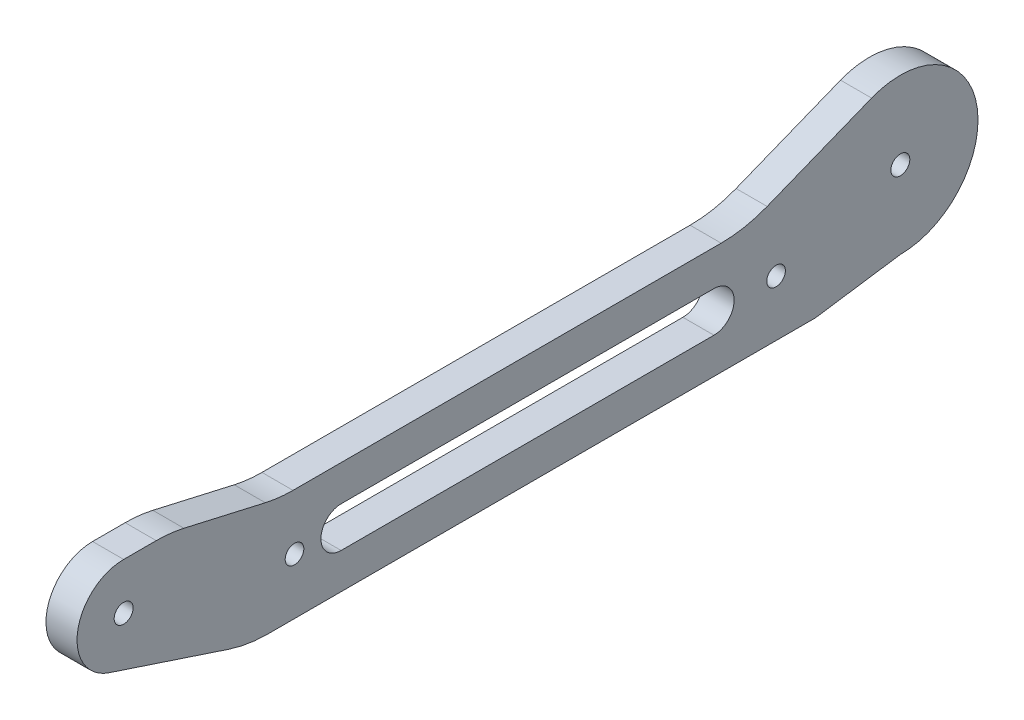
ISO-10303-21;
HEADER;
FILE_DESCRIPTION(('STEP AP214'),'2;1');
FILE_NAME('part.step','',(''),(''),'','','');
FILE_SCHEMA(('AUTOMOTIVE_DESIGN { 1 0 10303 214 1 1 1 1 }'));
ENDSEC;
DATA;
#1=APPLICATION_CONTEXT('core data for automotive mechanical design processes');
#2=APPLICATION_PROTOCOL_DEFINITION('international standard','automotive_design',2000,#1);
#3=PRODUCT_CONTEXT('',#1,'mechanical');
#4=PRODUCT('Part','Part','',(#3));
#5=PRODUCT_RELATED_PRODUCT_CATEGORY('part','',(#4));
#6=PRODUCT_DEFINITION_FORMATION('','',#4);
#7=PRODUCT_DEFINITION_CONTEXT('part definition',#1,'design');
#8=PRODUCT_DEFINITION('design','',#6,#7);
#9=PRODUCT_DEFINITION_SHAPE('','',#8);
#10=(LENGTH_UNIT() NAMED_UNIT(*) SI_UNIT(.MILLI.,.METRE.));
#11=(NAMED_UNIT(*) PLANE_ANGLE_UNIT() SI_UNIT($,.RADIAN.));
#12=(NAMED_UNIT(*) SI_UNIT($,.STERADIAN.) SOLID_ANGLE_UNIT());
#13=UNCERTAINTY_MEASURE_WITH_UNIT(LENGTH_MEASURE(1.E-05),#10,'distance_accuracy_value','');
#14=(GEOMETRIC_REPRESENTATION_CONTEXT(3) GLOBAL_UNCERTAINTY_ASSIGNED_CONTEXT((#13)) GLOBAL_UNIT_ASSIGNED_CONTEXT((#10,
#11,#12)) REPRESENTATION_CONTEXT('',''));
#15=CARTESIAN_POINT('',(0.,0.,0.));
#16=DIRECTION('',(0.,0.,1.));
#17=DIRECTION('',(1.,0.,0.));
#18=AXIS2_PLACEMENT_3D('',#15,#16,#17);
#19=CARTESIAN_POINT('',(2.5,0.,0.));
#20=DIRECTION('',(1.,0.,0.));
#21=DIRECTION('',(0.,0.,-1.));
#22=AXIS2_PLACEMENT_3D('',#19,#20,#21);
#23=PLANE('',#22);
#24=CARTESIAN_POINT('',(2.5,0.,125.));
#25=DIRECTION('',(-1.,0.,0.));
#26=DIRECTION('',(0.,0.,1.));
#27=AXIS2_PLACEMENT_3D('',#24,#25,#26);
#28=CIRCLE('',#27,1.525);
#29=CARTESIAN_POINT('',(2.5,0.,126.525));
#30=VERTEX_POINT('',#29);
#31=EDGE_CURVE('E231',#30,#30,#28,.T.);
#32=ORIENTED_EDGE('',*,*,#31,.T.);
#33=EDGE_LOOP('',(#32));
#34=FACE_BOUND('',#33,.T.);
#35=CARTESIAN_POINT('',(2.5,-5.50000000000001,97.5));
#36=DIRECTION('',(-1.,0.,0.));
#37=DIRECTION('',(0.,0.,1.));
#38=AXIS2_PLACEMENT_3D('',#35,#36,#37);
#39=CIRCLE('',#38,1.5);
#40=CARTESIAN_POINT('',(2.5,-5.50000000000001,99.));
#41=VERTEX_POINT('',#40);
#42=EDGE_CURVE('E234',#41,#41,#39,.T.);
#43=ORIENTED_EDGE('',*,*,#42,.T.);
#44=EDGE_LOOP('',(#43));
#45=FACE_BOUND('',#44,.T.);
#46=CARTESIAN_POINT('',(2.5,-5.5,20.));
#47=DIRECTION('',(-1.,0.,0.));
#48=DIRECTION('',(0.,0.,1.));
#49=AXIS2_PLACEMENT_3D('',#46,#47,#48);
#50=CIRCLE('',#49,1.5);
#51=CARTESIAN_POINT('',(2.5,-5.5,21.5));
#52=VERTEX_POINT('',#51);
#53=EDGE_CURVE('E237',#52,#52,#50,.T.);
#54=ORIENTED_EDGE('',*,*,#53,.T.);
#55=EDGE_LOOP('',(#54));
#56=FACE_BOUND('',#55,.T.);
#57=CARTESIAN_POINT('',(2.5,-5.5,90.));
#58=DIRECTION('',(-1.,0.,0.));
#59=DIRECTION('',(0.,0.,1.));
#60=AXIS2_PLACEMENT_3D('',#57,#58,#59);
#61=CIRCLE('',#60,3.25);
#62=CARTESIAN_POINT('',(2.5,-8.75,90.));
#63=VERTEX_POINT('',#62);
#64=CARTESIAN_POINT('',(2.5,-2.25,90.));
#65=VERTEX_POINT('',#64);
#66=EDGE_CURVE('E244',#63,#65,#61,.T.);
#67=ORIENTED_EDGE('',*,*,#66,.T.);
#68=DIRECTION('',(0.,0.,1.));
#69=VECTOR('',#68,1.);
#70=CARTESIAN_POINT('',(2.5,-2.24999999999998,0.));
#71=LINE('',#70,#69);
#72=CARTESIAN_POINT('',(2.5,-2.24999999999999,30.));
#73=VERTEX_POINT('',#72);
#74=EDGE_CURVE('E163',#65,#73,#71,.F.);
#75=ORIENTED_EDGE('',*,*,#74,.T.);
#76=CARTESIAN_POINT('',(2.5,-5.49999999999999,30.));
#77=DIRECTION('',(-1.,0.,0.));
#78=DIRECTION('',(0.,0.,1.));
#79=AXIS2_PLACEMENT_3D('',#76,#77,#78);
#80=CIRCLE('',#79,3.25);
#81=CARTESIAN_POINT('',(2.5,-8.74999999999999,30.));
#82=VERTEX_POINT('',#81);
#83=EDGE_CURVE('E241',#73,#82,#80,.T.);
#84=ORIENTED_EDGE('',*,*,#83,.T.);
#85=DIRECTION('',(0.,0.,1.));
#86=VECTOR('',#85,1.);
#87=CARTESIAN_POINT('',(2.5,-8.74999999999998,0.));
#88=LINE('',#87,#86);
#89=EDGE_CURVE('E159',#63,#82,#88,.F.);
#90=ORIENTED_EDGE('',*,*,#89,.F.);
#91=EDGE_LOOP('',(#67,#75,#84,#90));
#92=FACE_BOUND('',#91,.T.);
#93=DIRECTION('',(0.,0.,1.));
#94=VECTOR('',#93,1.);
#95=CARTESIAN_POINT('',(2.5,3.5,0.));
#96=LINE('',#95,#94);
#97=CARTESIAN_POINT('',(2.5,3.5,97.7433846449188));
#98=VERTEX_POINT('',#97);
#99=CARTESIAN_POINT('',(2.5,3.5,28.8353597506734));
#100=VERTEX_POINT('',#99);
#101=EDGE_CURVE('E173',#98,#100,#96,.F.);
#102=ORIENTED_EDGE('',*,*,#101,.F.);
#103=CARTESIAN_POINT('',(2.5,23.5,97.7433846449188));
#104=DIRECTION('',(1.,0.,0.));
#105=DIRECTION('',(0.,0.,-1.));
#106=AXIS2_PLACEMENT_3D('',#103,#104,#105);
#107=CIRCLE('',#106,20.);
#108=CARTESIAN_POINT('',(2.5,4.00282986856266,102.199880674962));
#109=VERTEX_POINT('',#108);
#110=EDGE_CURVE('E172',#98,#109,#107,.F.);
#111=ORIENTED_EDGE('',*,*,#110,.T.);
#112=DIRECTION('',(0.,0.222824801502141,0.974858506571867));
#113=VECTOR('',#112,1.);
#114=CARTESIAN_POINT('',(2.5,-18.3960434445307,4.20480993017844));
#115=LINE('',#114,#113);
#116=CARTESIAN_POINT('',(2.5,6.99717013143735,115.300119325038));
#117=VERTEX_POINT('',#116);
#118=EDGE_CURVE('E169',#117,#109,#115,.F.);
#119=ORIENTED_EDGE('',*,*,#118,.F.);
#120=CARTESIAN_POINT('',(2.5,-12.5,119.756615355081));
#121=DIRECTION('',(-1.,0.,0.));
#122=DIRECTION('',(0.,0.,1.));
#123=AXIS2_PLACEMENT_3D('',#120,#121,#122);
#124=CIRCLE('',#123,20.);
#125=CARTESIAN_POINT('',(2.5,7.5,119.756615355081));
#126=VERTEX_POINT('',#125);
#127=EDGE_CURVE('E246',#126,#117,#124,.T.);
#128=ORIENTED_EDGE('',*,*,#127,.F.);
#129=DIRECTION('',(0.,0.,1.));
#130=VECTOR('',#129,1.);
#131=CARTESIAN_POINT('',(2.5,7.4999999999998,0.));
#132=LINE('',#131,#130);
#133=CARTESIAN_POINT('',(2.5,7.50000000000001,125.));
#134=VERTEX_POINT('',#133);
#135=EDGE_CURVE('E147',#134,#126,#132,.F.);
#136=ORIENTED_EDGE('',*,*,#135,.F.);
#137=CARTESIAN_POINT('',(2.5,0.,125.));
#138=DIRECTION('',(-1.,0.,0.));
#139=DIRECTION('',(0.,0.,1.));
#140=AXIS2_PLACEMENT_3D('',#137,#138,#139);
#141=CIRCLE('',#140,7.50000000000001);
#142=CARTESIAN_POINT('',(2.5,-7.12200850271521,127.350956164468));
#143=VERTEX_POINT('',#142);
#144=EDGE_CURVE('E141',#143,#134,#141,.T.);
#145=ORIENTED_EDGE('',*,*,#144,.F.);
#146=DIRECTION('',(0.,-0.313460821929135,-0.949601133695359));
#147=VECTOR('',#146,1.);
#148=CARTESIAN_POINT('',(2.5,-44.3298524868384,14.6331670250296));
#149=LINE('',#148,#147);
#150=CARTESIAN_POINT('',(2.5,-13.4920226739072,108.05357590051));
#151=VERTEX_POINT('',#150);
#152=EDGE_CURVE('E132',#151,#143,#149,.F.);
#153=ORIENTED_EDGE('',*,*,#152,.F.);
#154=CARTESIAN_POINT('',(2.5,5.5,101.784359461928));
#155=DIRECTION('',(1.,0.,0.));
#156=DIRECTION('',(0.,0.,-1.));
#157=AXIS2_PLACEMENT_3D('',#154,#155,#156);
#158=CIRCLE('',#157,20.);
#159=CARTESIAN_POINT('',(2.5,-14.5,101.784359461928));
#160=VERTEX_POINT('',#159);
#161=EDGE_CURVE('E153',#160,#151,#158,.F.);
#162=ORIENTED_EDGE('',*,*,#161,.F.);
#163=DIRECTION('',(0.,0.,1.));
#164=VECTOR('',#163,1.);
#165=CARTESIAN_POINT('',(2.5,-14.5,0.));
#166=LINE('',#165,#164);
#167=CARTESIAN_POINT('',(2.5,-14.5,13.675));
#168=VERTEX_POINT('',#167);
#169=EDGE_CURVE('E188',#160,#168,#166,.F.);
#170=ORIENTED_EDGE('',*,*,#169,.T.);
#171=DIRECTION('',(0.,-0.144712790159397,0.989473702714874));
#172=VECTOR('',#171,1.);
#173=CARTESIAN_POINT('',(2.5,-12.2382276045535,-1.78986875386523));
#174=LINE('',#173,#172);
#175=CARTESIAN_POINT('',(2.5,-12.5,0.));
#176=VERTEX_POINT('',#175);
#177=EDGE_CURVE('E181',#168,#176,#174,.F.);
#178=ORIENTED_EDGE('',*,*,#177,.T.);
#179=CARTESIAN_POINT('',(2.5,0.,0.));
#180=DIRECTION('',(-1.,0.,0.));
#181=DIRECTION('',(0.,0.,1.));
#182=AXIS2_PLACEMENT_3D('',#179,#180,#181);
#183=CIRCLE('',#182,12.5);
#184=CARTESIAN_POINT('',(2.5,11.6132366611717,4.62414686743597));
#185=VERTEX_POINT('',#184);
#186=EDGE_CURVE('E184',#185,#176,#183,.T.);
#187=ORIENTED_EDGE('',*,*,#186,.F.);
#188=DIRECTION('',(0.,-0.369931749394877,0.929058932893735));
#189=VECTOR('',#188,1.);
#190=CARTESIAN_POINT('',(2.5,11.6132366611717,4.62414686743597));
#191=LINE('',#190,#189);
#192=CARTESIAN_POINT('',(2.5,4.9188213421253,21.4367247627758));
#193=VERTEX_POINT('',#192);
#194=EDGE_CURVE('E177',#193,#185,#191,.F.);
#195=ORIENTED_EDGE('',*,*,#194,.F.);
#196=CARTESIAN_POINT('',(2.5,23.5,28.8353597506734));
#197=DIRECTION('',(1.,0.,0.));
#198=DIRECTION('',(0.,0.,-1.));
#199=AXIS2_PLACEMENT_3D('',#196,#197,#198);
#200=CIRCLE('',#199,20.);
#201=EDGE_CURVE('E176',#193,#100,#200,.F.);
#202=ORIENTED_EDGE('',*,*,#201,.T.);
#203=EDGE_LOOP('',(#102,#111,#119,#128,#136,#145,#153,#162,#170,#178,#187,#195,#202));
#204=FACE_BOUND('',#203,.T.);
#205=CARTESIAN_POINT('',(2.5,0.,0.));
#206=DIRECTION('',(-1.,0.,0.));
#207=DIRECTION('',(0.,0.,1.));
#208=AXIS2_PLACEMENT_3D('',#205,#206,#207);
#209=CIRCLE('',#208,1.525);
#210=CARTESIAN_POINT('',(2.5,0.,1.525));
#211=VERTEX_POINT('',#210);
#212=EDGE_CURVE('E19',#211,#211,#209,.T.);
#213=ORIENTED_EDGE('',*,*,#212,.T.);
#214=EDGE_LOOP('',(#213));
#215=FACE_BOUND('',#214,.T.);
#216=ADVANCED_FACE('F16',(#34,#45,#56,#92,#204,#215),#23,.T.);
#217=CARTESIAN_POINT('',(2.5,0.,0.));
#218=DIRECTION('',(-1.,0.,0.));
#219=DIRECTION('',(0.,0.,1.));
#220=AXIS2_PLACEMENT_3D('',#217,#218,#219);
#221=CYLINDRICAL_SURFACE('',#220,1.525);
#222=CARTESIAN_POINT('',(-2.5,0.,0.));
#223=DIRECTION('',(-1.,0.,0.));
#224=DIRECTION('',(0.,0.,1.));
#225=AXIS2_PLACEMENT_3D('',#222,#223,#224);
#226=CIRCLE('',#225,1.525);
#227=CARTESIAN_POINT('',(-2.5,0.,1.525));
#228=VERTEX_POINT('',#227);
#229=EDGE_CURVE('E228',#228,#228,#226,.T.);
#230=ORIENTED_EDGE('',*,*,#229,.T.);
#231=EDGE_LOOP('',(#230));
#232=FACE_BOUND('',#231,.T.);
#233=ORIENTED_EDGE('',*,*,#212,.F.);
#234=EDGE_LOOP('',(#233));
#235=FACE_BOUND('',#234,.T.);
#236=ADVANCED_FACE('F405',(#232,#235),#221,.F.);
#237=CARTESIAN_POINT('',(2.5,0.,125.));
#238=DIRECTION('',(-1.,0.,0.));
#239=DIRECTION('',(0.,0.,1.));
#240=AXIS2_PLACEMENT_3D('',#237,#238,#239);
#241=CYLINDRICAL_SURFACE('',#240,7.50000000000001);
#242=CARTESIAN_POINT('',(-2.5,0.,125.));
#243=DIRECTION('',(-1.,0.,0.));
#244=DIRECTION('',(0.,0.,1.));
#245=AXIS2_PLACEMENT_3D('',#242,#243,#244);
#246=CIRCLE('',#245,7.50000000000001);
#247=CARTESIAN_POINT('',(-2.5,7.50000000000001,125.));
#248=VERTEX_POINT('',#247);
#249=CARTESIAN_POINT('',(-2.5,-7.1220085027152,127.350956164469));
#250=VERTEX_POINT('',#249);
#251=EDGE_CURVE('E152',#248,#250,#246,.F.);
#252=ORIENTED_EDGE('',*,*,#251,.T.);
#253=DIRECTION('',(1.,0.,0.));
#254=VECTOR('',#253,1.);
#255=CARTESIAN_POINT('',(2.5,-7.12200850271521,127.350956164468));
#256=LINE('',#255,#254);
#257=EDGE_CURVE('E137',#143,#250,#256,.F.);
#258=ORIENTED_EDGE('',*,*,#257,.F.);
#259=ORIENTED_EDGE('',*,*,#144,.T.);
#260=DIRECTION('',(1.,0.,0.));
#261=VECTOR('',#260,1.);
#262=CARTESIAN_POINT('',(2.5,7.50000000000001,125.));
#263=LINE('',#262,#261);
#264=EDGE_CURVE('E162',#248,#134,#263,.T.);
#265=ORIENTED_EDGE('',*,*,#264,.F.);
#266=EDGE_LOOP('',(#252,#258,#259,#265));
#267=FACE_BOUND('',#266,.T.);
#268=ADVANCED_FACE('F151',(#267),#241,.T.);
#269=CARTESIAN_POINT('',(2.5,-44.3298524868384,14.6331670250296));
#270=DIRECTION('',(0.,-0.949601133695359,0.313460821929135));
#271=DIRECTION('',(0.,-0.313460821929135,-0.949601133695359));
#272=AXIS2_PLACEMENT_3D('',#269,#270,#271);
#273=PLANE('',#272);
#274=ORIENTED_EDGE('',*,*,#152,.T.);
#275=ORIENTED_EDGE('',*,*,#257,.T.);
#276=DIRECTION('',(0.,-0.313460821929135,-0.949601133695359));
#277=VECTOR('',#276,1.);
#278=CARTESIAN_POINT('',(-2.5,-7.12200850271521,127.350956164468));
#279=LINE('',#278,#277);
#280=CARTESIAN_POINT('',(-2.5,-13.4920226739072,108.05357590051));
#281=VERTEX_POINT('',#280);
#282=EDGE_CURVE('E226',#250,#281,#279,.T.);
#283=ORIENTED_EDGE('',*,*,#282,.T.);
#284=DIRECTION('',(1.,0.,0.));
#285=VECTOR('',#284,1.);
#286=CARTESIAN_POINT('',(2.5,-13.4920226739072,108.05357590051));
#287=LINE('',#286,#285);
#288=EDGE_CURVE('E139',#151,#281,#287,.F.);
#289=ORIENTED_EDGE('',*,*,#288,.F.);
#290=EDGE_LOOP('',(#274,#275,#283,#289));
#291=FACE_BOUND('',#290,.T.);
#292=ADVANCED_FACE('F134',(#291),#273,.T.);
#293=CARTESIAN_POINT('',(2.5,5.5,101.784359461928));
#294=DIRECTION('',(1.,0.,0.));
#295=DIRECTION('',(0.,0.,-1.));
#296=AXIS2_PLACEMENT_3D('',#293,#294,#295);
#297=CYLINDRICAL_SURFACE('',#296,20.);
#298=CARTESIAN_POINT('',(-2.5,5.5,101.784359461928));
#299=DIRECTION('',(1.,0.,0.));
#300=DIRECTION('',(0.,0.,-1.));
#301=AXIS2_PLACEMENT_3D('',#298,#299,#300);
#302=CIRCLE('',#301,20.);
#303=CARTESIAN_POINT('',(-2.5,-14.5,101.784359461928));
#304=VERTEX_POINT('',#303);
#305=EDGE_CURVE('E222',#281,#304,#302,.T.);
#306=ORIENTED_EDGE('',*,*,#305,.T.);
#307=DIRECTION('',(1.,0.,0.));
#308=VECTOR('',#307,1.);
#309=CARTESIAN_POINT('',(2.5,-14.5,101.784359461928));
#310=LINE('',#309,#308);
#311=EDGE_CURVE('E191',#304,#160,#310,.T.);
#312=ORIENTED_EDGE('',*,*,#311,.T.);
#313=ORIENTED_EDGE('',*,*,#161,.T.);
#314=ORIENTED_EDGE('',*,*,#288,.T.);
#315=EDGE_LOOP('',(#306,#312,#313,#314));
#316=FACE_BOUND('',#315,.T.);
#317=ADVANCED_FACE('F269',(#316),#297,.T.);
#318=CARTESIAN_POINT('',(2.5,-14.5,0.));
#319=DIRECTION('',(0.,1.,0.));
#320=DIRECTION('',(0.,0.,1.));
#321=AXIS2_PLACEMENT_3D('',#318,#319,#320);
#322=PLANE('',#321);
#323=ORIENTED_EDGE('',*,*,#311,.F.);
#324=DIRECTION('',(0.,0.,-1.));
#325=VECTOR('',#324,1.);
#326=CARTESIAN_POINT('',(-2.5,-14.5,0.));
#327=LINE('',#326,#325);
#328=CARTESIAN_POINT('',(-2.5,-14.5,13.6749999999999));
#329=VERTEX_POINT('',#328);
#330=EDGE_CURVE('E225',#304,#329,#327,.T.);
#331=ORIENTED_EDGE('',*,*,#330,.T.);
#332=DIRECTION('',(1.,0.,0.));
#333=VECTOR('',#332,1.);
#334=CARTESIAN_POINT('',(2.5,-14.5,13.675));
#335=LINE('',#334,#333);
#336=EDGE_CURVE('E185',#329,#168,#335,.T.);
#337=ORIENTED_EDGE('',*,*,#336,.T.);
#338=ORIENTED_EDGE('',*,*,#169,.F.);
#339=EDGE_LOOP('',(#323,#331,#337,#338));
#340=FACE_BOUND('',#339,.T.);
#341=ADVANCED_FACE('F315',(#340),#322,.F.);
#342=CARTESIAN_POINT('',(2.5,-12.2382276045535,-1.78986875386523));
#343=DIRECTION('',(0.,0.989473702714874,0.144712790159397));
#344=DIRECTION('',(0.,-0.144712790159397,0.989473702714874));
#345=AXIS2_PLACEMENT_3D('',#342,#343,#344);
#346=PLANE('',#345);
#347=DIRECTION('',(-1.,0.,0.));
#348=VECTOR('',#347,1.);
#349=CARTESIAN_POINT('',(2.5,-12.5,0.));
#350=LINE('',#349,#348);
#351=CARTESIAN_POINT('',(-2.5,-12.5,0.));
#352=VERTEX_POINT('',#351);
#353=EDGE_CURVE('E180',#176,#352,#350,.T.);
#354=ORIENTED_EDGE('',*,*,#353,.F.);
#355=ORIENTED_EDGE('',*,*,#177,.F.);
#356=ORIENTED_EDGE('',*,*,#336,.F.);
#357=DIRECTION('',(0.,0.144712790159397,-0.989473702714874));
#358=VECTOR('',#357,1.);
#359=CARTESIAN_POINT('',(-2.5,-14.5,13.675));
#360=LINE('',#359,#358);
#361=EDGE_CURVE('E221',#329,#352,#360,.T.);
#362=ORIENTED_EDGE('',*,*,#361,.T.);
#363=EDGE_LOOP('',(#354,#355,#356,#362));
#364=FACE_BOUND('',#363,.T.);
#365=ADVANCED_FACE('F306',(#364),#346,.F.);
#366=CARTESIAN_POINT('',(2.5,0.,0.));
#367=DIRECTION('',(-1.,0.,0.));
#368=DIRECTION('',(0.,0.,1.));
#369=AXIS2_PLACEMENT_3D('',#366,#367,#368);
#370=CYLINDRICAL_SURFACE('',#369,12.5);
#371=ORIENTED_EDGE('',*,*,#186,.T.);
#372=ORIENTED_EDGE('',*,*,#353,.T.);
#373=CARTESIAN_POINT('',(-2.5,0.,0.));
#374=DIRECTION('',(-1.,0.,0.));
#375=DIRECTION('',(0.,0.,1.));
#376=AXIS2_PLACEMENT_3D('',#373,#374,#375);
#377=CIRCLE('',#376,12.5);
#378=CARTESIAN_POINT('',(-2.5,11.6132366611717,4.62414686743597));
#379=VERTEX_POINT('',#378);
#380=EDGE_CURVE('E218',#352,#379,#377,.F.);
#381=ORIENTED_EDGE('',*,*,#380,.T.);
#382=DIRECTION('',(1.,0.,0.));
#383=VECTOR('',#382,1.);
#384=CARTESIAN_POINT('',(2.5,11.6132366611717,4.62414686743597));
#385=LINE('',#384,#383);
#386=EDGE_CURVE('E179',#185,#379,#385,.F.);
#387=ORIENTED_EDGE('',*,*,#386,.F.);
#388=EDGE_LOOP('',(#371,#372,#381,#387));
#389=FACE_BOUND('',#388,.T.);
#390=ADVANCED_FACE('F304',(#389),#370,.T.);
#391=CARTESIAN_POINT('',(2.5,11.6132366611717,4.62414686743597));
#392=DIRECTION('',(0.,0.929058932893735,0.369931749394877));
#393=DIRECTION('',(0.,-0.369931749394877,0.929058932893735));
#394=AXIS2_PLACEMENT_3D('',#391,#392,#393);
#395=PLANE('',#394);
#396=ORIENTED_EDGE('',*,*,#194,.T.);
#397=ORIENTED_EDGE('',*,*,#386,.T.);
#398=DIRECTION('',(0.,-0.369931749394877,0.929058932893735));
#399=VECTOR('',#398,1.);
#400=CARTESIAN_POINT('',(-2.5,11.6132366611717,4.62414686743596));
#401=LINE('',#400,#399);
#402=CARTESIAN_POINT('',(-2.5,4.9188213421253,21.4367247627758));
#403=VERTEX_POINT('',#402);
#404=EDGE_CURVE('E217',#379,#403,#401,.T.);
#405=ORIENTED_EDGE('',*,*,#404,.T.);
#406=DIRECTION('',(1.,0.,0.));
#407=VECTOR('',#406,1.);
#408=CARTESIAN_POINT('',(2.5,4.91882134212529,21.4367247627758));
#409=LINE('',#408,#407);
#410=EDGE_CURVE('E253',#403,#193,#409,.T.);
#411=ORIENTED_EDGE('',*,*,#410,.T.);
#412=EDGE_LOOP('',(#396,#397,#405,#411));
#413=FACE_BOUND('',#412,.T.);
#414=ADVANCED_FACE('F299',(#413),#395,.T.);
#415=CARTESIAN_POINT('',(2.5,23.5,28.8353597506734));
#416=DIRECTION('',(1.,0.,0.));
#417=DIRECTION('',(0.,0.,-1.));
#418=AXIS2_PLACEMENT_3D('',#415,#416,#417);
#419=CYLINDRICAL_SURFACE('',#418,20.);
#420=ORIENTED_EDGE('',*,*,#410,.F.);
#421=CARTESIAN_POINT('',(-2.5,23.5,28.8353597506734));
#422=DIRECTION('',(1.,0.,0.));
#423=DIRECTION('',(0.,0.,-1.));
#424=AXIS2_PLACEMENT_3D('',#421,#422,#423);
#425=CIRCLE('',#424,20.);
#426=CARTESIAN_POINT('',(-2.5,3.5,28.8353597506734));
#427=VERTEX_POINT('',#426);
#428=EDGE_CURVE('E214',#403,#427,#425,.F.);
#429=ORIENTED_EDGE('',*,*,#428,.T.);
#430=DIRECTION('',(1.,0.,0.));
#431=VECTOR('',#430,1.);
#432=CARTESIAN_POINT('',(2.5,3.5,28.8353597506734));
#433=LINE('',#432,#431);
#434=EDGE_CURVE('E175',#100,#427,#433,.F.);
#435=ORIENTED_EDGE('',*,*,#434,.F.);
#436=ORIENTED_EDGE('',*,*,#201,.F.);
#437=EDGE_LOOP('',(#420,#429,#435,#436));
#438=FACE_BOUND('',#437,.T.);
#439=ADVANCED_FACE('F313',(#438),#419,.F.);
#440=CARTESIAN_POINT('',(2.5,3.5,0.));
#441=DIRECTION('',(0.,1.,0.));
#442=DIRECTION('',(0.,0.,1.));
#443=AXIS2_PLACEMENT_3D('',#440,#441,#442);
#444=PLANE('',#443);
#445=ORIENTED_EDGE('',*,*,#101,.T.);
#446=ORIENTED_EDGE('',*,*,#434,.T.);
#447=DIRECTION('',(0.,0.,-1.));
#448=VECTOR('',#447,1.);
#449=CARTESIAN_POINT('',(-2.5,3.5,0.));
#450=LINE('',#449,#448);
#451=CARTESIAN_POINT('',(-2.5,3.5,97.7433846449188));
#452=VERTEX_POINT('',#451);
#453=EDGE_CURVE('E213',#427,#452,#450,.F.);
#454=ORIENTED_EDGE('',*,*,#453,.T.);
#455=DIRECTION('',(1.,0.,0.));
#456=VECTOR('',#455,1.);
#457=CARTESIAN_POINT('',(2.5,3.5,97.7433846449188));
#458=LINE('',#457,#456);
#459=EDGE_CURVE('E250',#452,#98,#458,.T.);
#460=ORIENTED_EDGE('',*,*,#459,.T.);
#461=EDGE_LOOP('',(#445,#446,#454,#460));
#462=FACE_BOUND('',#461,.T.);
#463=ADVANCED_FACE('F368',(#462),#444,.T.);
#464=CARTESIAN_POINT('',(2.5,23.5,97.7433846449188));
#465=DIRECTION('',(1.,0.,0.));
#466=DIRECTION('',(0.,0.,-1.));
#467=AXIS2_PLACEMENT_3D('',#464,#465,#466);
#468=CYLINDRICAL_SURFACE('',#467,20.);
#469=ORIENTED_EDGE('',*,*,#459,.F.);
#470=CARTESIAN_POINT('',(-2.5,23.5,97.7433846449188));
#471=DIRECTION('',(1.,0.,0.));
#472=DIRECTION('',(0.,0.,-1.));
#473=AXIS2_PLACEMENT_3D('',#470,#471,#472);
#474=CIRCLE('',#473,20.);
#475=CARTESIAN_POINT('',(-2.5,4.00282986856266,102.199880674962));
#476=VERTEX_POINT('',#475);
#477=EDGE_CURVE('E210',#452,#476,#474,.F.);
#478=ORIENTED_EDGE('',*,*,#477,.T.);
#479=DIRECTION('',(1.,0.,0.));
#480=VECTOR('',#479,1.);
#481=CARTESIAN_POINT('',(2.5,4.00282986856267,102.199880674962));
#482=LINE('',#481,#480);
#483=EDGE_CURVE('E171',#109,#476,#482,.F.);
#484=ORIENTED_EDGE('',*,*,#483,.F.);
#485=ORIENTED_EDGE('',*,*,#110,.F.);
#486=EDGE_LOOP('',(#469,#478,#484,#485));
#487=FACE_BOUND('',#486,.T.);
#488=ADVANCED_FACE('F364',(#487),#468,.F.);
#489=CARTESIAN_POINT('',(2.5,-18.3960434445307,4.20480993017844));
#490=DIRECTION('',(0.,0.974858506571867,-0.222824801502141));
#491=DIRECTION('',(0.,0.222824801502141,0.974858506571867));
#492=AXIS2_PLACEMENT_3D('',#489,#490,#491);
#493=PLANE('',#492);
#494=ORIENTED_EDGE('',*,*,#118,.T.);
#495=ORIENTED_EDGE('',*,*,#483,.T.);
#496=DIRECTION('',(0.,0.222824801502141,0.974858506571867));
#497=VECTOR('',#496,1.);
#498=CARTESIAN_POINT('',(-2.5,4.00282986856266,102.199880674962));
#499=LINE('',#498,#497);
#500=CARTESIAN_POINT('',(-2.5,6.99717013143735,115.300119325038));
#501=VERTEX_POINT('',#500);
#502=EDGE_CURVE('E209',#476,#501,#499,.T.);
#503=ORIENTED_EDGE('',*,*,#502,.T.);
#504=DIRECTION('',(-1.,0.,0.));
#505=VECTOR('',#504,1.);
#506=CARTESIAN_POINT('',(2.5,6.99717013143735,115.300119325038));
#507=LINE('',#506,#505);
#508=EDGE_CURVE('E168',#117,#501,#507,.T.);
#509=ORIENTED_EDGE('',*,*,#508,.F.);
#510=EDGE_LOOP('',(#494,#495,#503,#509));
#511=FACE_BOUND('',#510,.T.);
#512=ADVANCED_FACE('F360',(#511),#493,.T.);
#513=CARTESIAN_POINT('',(2.5,-12.5,119.756615355081));
#514=DIRECTION('',(-1.,0.,0.));
#515=DIRECTION('',(0.,0.,1.));
#516=AXIS2_PLACEMENT_3D('',#513,#514,#515);
#517=CYLINDRICAL_SURFACE('',#516,20.);
#518=CARTESIAN_POINT('',(-2.5,-12.5,119.756615355081));
#519=DIRECTION('',(-1.,0.,0.));
#520=DIRECTION('',(0.,0.,1.));
#521=AXIS2_PLACEMENT_3D('',#518,#519,#520);
#522=CIRCLE('',#521,20.);
#523=CARTESIAN_POINT('',(-2.5,7.50000000000001,119.756615355081));
#524=VERTEX_POINT('',#523);
#525=EDGE_CURVE('E205',#501,#524,#522,.F.);
#526=ORIENTED_EDGE('',*,*,#525,.T.);
#527=DIRECTION('',(1.,0.,0.));
#528=VECTOR('',#527,1.);
#529=CARTESIAN_POINT('',(2.5,7.5,119.756615355081));
#530=LINE('',#529,#528);
#531=EDGE_CURVE('E167',#126,#524,#530,.F.);
#532=ORIENTED_EDGE('',*,*,#531,.F.);
#533=ORIENTED_EDGE('',*,*,#127,.T.);
#534=ORIENTED_EDGE('',*,*,#508,.T.);
#535=EDGE_LOOP('',(#526,#532,#533,#534));
#536=FACE_BOUND('',#535,.T.);
#537=ADVANCED_FACE('F356',(#536),#517,.T.);
#538=CARTESIAN_POINT('',(2.5,7.4999999999998,0.));
#539=DIRECTION('',(0.,1.,0.));
#540=DIRECTION('',(0.,0.,1.));
#541=AXIS2_PLACEMENT_3D('',#538,#539,#540);
#542=PLANE('',#541);
#543=DIRECTION('',(0.,0.,-1.));
#544=VECTOR('',#543,1.);
#545=CARTESIAN_POINT('',(-2.5,7.50000000000001,0.));
#546=LINE('',#545,#544);
#547=EDGE_CURVE('E208',#524,#248,#546,.F.);
#548=ORIENTED_EDGE('',*,*,#547,.T.);
#549=ORIENTED_EDGE('',*,*,#264,.T.);
#550=ORIENTED_EDGE('',*,*,#135,.T.);
#551=ORIENTED_EDGE('',*,*,#531,.T.);
#552=EDGE_LOOP('',(#548,#549,#550,#551));
#553=FACE_BOUND('',#552,.T.);
#554=ADVANCED_FACE('F352',(#553),#542,.T.);
#555=CARTESIAN_POINT('',(2.5,-8.74999999999998,0.));
#556=DIRECTION('',(0.,1.,0.));
#557=DIRECTION('',(0.,0.,1.));
#558=AXIS2_PLACEMENT_3D('',#555,#556,#557);
#559=PLANE('',#558);
#560=ORIENTED_EDGE('',*,*,#89,.T.);
#561=DIRECTION('',(-1.,0.,0.));
#562=VECTOR('',#561,1.);
#563=CARTESIAN_POINT('',(2.5,-8.74999999999999,30.));
#564=LINE('',#563,#562);
#565=CARTESIAN_POINT('',(-2.5,-8.74999999999999,30.));
#566=VERTEX_POINT('',#565);
#567=EDGE_CURVE('E240',#82,#566,#564,.T.);
#568=ORIENTED_EDGE('',*,*,#567,.T.);
#569=DIRECTION('',(0.,0.,-1.));
#570=VECTOR('',#569,1.);
#571=CARTESIAN_POINT('',(-2.5,-8.74999999999999,0.));
#572=LINE('',#571,#570);
#573=CARTESIAN_POINT('',(-2.5,-8.75,90.));
#574=VERTEX_POINT('',#573);
#575=EDGE_CURVE('E204',#566,#574,#572,.F.);
#576=ORIENTED_EDGE('',*,*,#575,.T.);
#577=DIRECTION('',(-1.,0.,0.));
#578=VECTOR('',#577,1.);
#579=CARTESIAN_POINT('',(2.5,-8.75,90.));
#580=LINE('',#579,#578);
#581=EDGE_CURVE('E161',#574,#63,#580,.F.);
#582=ORIENTED_EDGE('',*,*,#581,.T.);
#583=EDGE_LOOP('',(#560,#568,#576,#582));
#584=FACE_BOUND('',#583,.T.);
#585=ADVANCED_FACE('F348',(#584),#559,.T.);
#586=CARTESIAN_POINT('',(2.5,-5.5,90.));
#587=DIRECTION('',(-1.,0.,0.));
#588=DIRECTION('',(0.,0.,1.));
#589=AXIS2_PLACEMENT_3D('',#586,#587,#588);
#590=CYLINDRICAL_SURFACE('',#589,3.25);
#591=ORIENTED_EDGE('',*,*,#66,.F.);
#592=ORIENTED_EDGE('',*,*,#581,.F.);
#593=CARTESIAN_POINT('',(-2.5,-5.5,90.));
#594=DIRECTION('',(-1.,0.,0.));
#595=DIRECTION('',(0.,0.,1.));
#596=AXIS2_PLACEMENT_3D('',#593,#594,#595);
#597=CIRCLE('',#596,3.25);
#598=CARTESIAN_POINT('',(-2.5,-2.25,90.));
#599=VERTEX_POINT('',#598);
#600=EDGE_CURVE('E202',#574,#599,#597,.T.);
#601=ORIENTED_EDGE('',*,*,#600,.T.);
#602=DIRECTION('',(1.,0.,0.));
#603=VECTOR('',#602,1.);
#604=CARTESIAN_POINT('',(2.5,-2.25,90.));
#605=LINE('',#604,#603);
#606=EDGE_CURVE('E165',#599,#65,#605,.T.);
#607=ORIENTED_EDGE('',*,*,#606,.T.);
#608=EDGE_LOOP('',(#591,#592,#601,#607));
#609=FACE_BOUND('',#608,.T.);
#610=ADVANCED_FACE('F344',(#609),#590,.F.);
#611=CARTESIAN_POINT('',(2.5,-2.24999999999998,0.));
#612=DIRECTION('',(0.,1.,0.));
#613=DIRECTION('',(0.,0.,1.));
#614=AXIS2_PLACEMENT_3D('',#611,#612,#613);
#615=PLANE('',#614);
#616=DIRECTION('',(-1.,0.,0.));
#617=VECTOR('',#616,1.);
#618=CARTESIAN_POINT('',(2.5,-2.24999999999999,30.));
#619=LINE('',#618,#617);
#620=CARTESIAN_POINT('',(-2.5,-2.24999999999999,30.));
#621=VERTEX_POINT('',#620);
#622=EDGE_CURVE('E34',#621,#73,#619,.F.);
#623=ORIENTED_EDGE('',*,*,#622,.T.);
#624=ORIENTED_EDGE('',*,*,#74,.F.);
#625=ORIENTED_EDGE('',*,*,#606,.F.);
#626=DIRECTION('',(0.,0.,-1.));
#627=VECTOR('',#626,1.);
#628=CARTESIAN_POINT('',(-2.5,-2.25,0.));
#629=LINE('',#628,#627);
#630=EDGE_CURVE('E201',#599,#621,#629,.T.);
#631=ORIENTED_EDGE('',*,*,#630,.T.);
#632=EDGE_LOOP('',(#623,#624,#625,#631));
#633=FACE_BOUND('',#632,.T.);
#634=ADVANCED_FACE('F341',(#633),#615,.F.);
#635=CARTESIAN_POINT('',(2.5,-5.49999999999999,30.));
#636=DIRECTION('',(-1.,0.,0.));
#637=DIRECTION('',(0.,0.,1.));
#638=AXIS2_PLACEMENT_3D('',#635,#636,#637);
#639=CYLINDRICAL_SURFACE('',#638,3.25);
#640=ORIENTED_EDGE('',*,*,#567,.F.);
#641=ORIENTED_EDGE('',*,*,#83,.F.);
#642=ORIENTED_EDGE('',*,*,#622,.F.);
#643=CARTESIAN_POINT('',(-2.5,-5.49999999999999,30.));
#644=DIRECTION('',(-1.,0.,0.));
#645=DIRECTION('',(0.,0.,1.));
#646=AXIS2_PLACEMENT_3D('',#643,#644,#645);
#647=CIRCLE('',#646,3.25);
#648=EDGE_CURVE('E199',#621,#566,#647,.T.);
#649=ORIENTED_EDGE('',*,*,#648,.T.);
#650=EDGE_LOOP('',(#640,#641,#642,#649));
#651=FACE_BOUND('',#650,.T.);
#652=ADVANCED_FACE('F337',(#651),#639,.F.);
#653=CARTESIAN_POINT('',(2.5,-5.5,20.));
#654=DIRECTION('',(-1.,0.,0.));
#655=DIRECTION('',(0.,0.,1.));
#656=AXIS2_PLACEMENT_3D('',#653,#654,#655);
#657=CYLINDRICAL_SURFACE('',#656,1.5);
#658=CARTESIAN_POINT('',(-2.5,-5.5,20.));
#659=DIRECTION('',(-1.,0.,0.));
#660=DIRECTION('',(0.,0.,1.));
#661=AXIS2_PLACEMENT_3D('',#658,#659,#660);
#662=CIRCLE('',#661,1.5);
#663=CARTESIAN_POINT('',(-2.5,-5.5,21.5));
#664=VERTEX_POINT('',#663);
#665=EDGE_CURVE('E196',#664,#664,#662,.T.);
#666=ORIENTED_EDGE('',*,*,#665,.T.);
#667=EDGE_LOOP('',(#666));
#668=FACE_BOUND('',#667,.T.);
#669=ORIENTED_EDGE('',*,*,#53,.F.);
#670=EDGE_LOOP('',(#669));
#671=FACE_BOUND('',#670,.T.);
#672=ADVANCED_FACE('F333',(#668,#671),#657,.F.);
#673=CARTESIAN_POINT('',(2.5,-5.50000000000001,97.5));
#674=DIRECTION('',(-1.,0.,0.));
#675=DIRECTION('',(0.,0.,1.));
#676=AXIS2_PLACEMENT_3D('',#673,#674,#675);
#677=CYLINDRICAL_SURFACE('',#676,1.5);
#678=CARTESIAN_POINT('',(-2.5,-5.50000000000001,97.5));
#679=DIRECTION('',(-1.,0.,0.));
#680=DIRECTION('',(0.,0.,1.));
#681=AXIS2_PLACEMENT_3D('',#678,#679,#680);
#682=CIRCLE('',#681,1.5);
#683=CARTESIAN_POINT('',(-2.5,-5.50000000000001,99.));
#684=VERTEX_POINT('',#683);
#685=EDGE_CURVE('E25',#684,#684,#682,.T.);
#686=ORIENTED_EDGE('',*,*,#685,.T.);
#687=EDGE_LOOP('',(#686));
#688=FACE_BOUND('',#687,.T.);
#689=ORIENTED_EDGE('',*,*,#42,.F.);
#690=EDGE_LOOP('',(#689));
#691=FACE_BOUND('',#690,.T.);
#692=ADVANCED_FACE('F325',(#688,#691),#677,.F.);
#693=CARTESIAN_POINT('',(2.5,0.,125.));
#694=DIRECTION('',(-1.,0.,0.));
#695=DIRECTION('',(0.,0.,1.));
#696=AXIS2_PLACEMENT_3D('',#693,#694,#695);
#697=CYLINDRICAL_SURFACE('',#696,1.525);
#698=CARTESIAN_POINT('',(-2.5,0.,125.));
#699=DIRECTION('',(-1.,0.,0.));
#700=DIRECTION('',(0.,0.,1.));
#701=AXIS2_PLACEMENT_3D('',#698,#699,#700);
#702=CIRCLE('',#701,1.525);
#703=CARTESIAN_POINT('',(-2.5,0.,126.525));
#704=VERTEX_POINT('',#703);
#705=EDGE_CURVE('E11',#704,#704,#702,.T.);
#706=ORIENTED_EDGE('',*,*,#705,.T.);
#707=EDGE_LOOP('',(#706));
#708=FACE_BOUND('',#707,.T.);
#709=ORIENTED_EDGE('',*,*,#31,.F.);
#710=EDGE_LOOP('',(#709));
#711=FACE_BOUND('',#710,.T.);
#712=ADVANCED_FACE('F319',(#708,#711),#697,.F.);
#713=CARTESIAN_POINT('',(-2.5,0.,0.));
#714=DIRECTION('',(1.,0.,0.));
#715=DIRECTION('',(0.,0.,-1.));
#716=AXIS2_PLACEMENT_3D('',#713,#714,#715);
#717=PLANE('',#716);
#718=ORIENTED_EDGE('',*,*,#705,.F.);
#719=EDGE_LOOP('',(#718));
#720=FACE_BOUND('',#719,.T.);
#721=ORIENTED_EDGE('',*,*,#685,.F.);
#722=EDGE_LOOP('',(#721));
#723=FACE_BOUND('',#722,.T.);
#724=ORIENTED_EDGE('',*,*,#665,.F.);
#725=EDGE_LOOP('',(#724));
#726=FACE_BOUND('',#725,.T.);
#727=ORIENTED_EDGE('',*,*,#630,.F.);
#728=ORIENTED_EDGE('',*,*,#600,.F.);
#729=ORIENTED_EDGE('',*,*,#575,.F.);
#730=ORIENTED_EDGE('',*,*,#648,.F.);
#731=EDGE_LOOP('',(#727,#728,#729,#730));
#732=FACE_BOUND('',#731,.T.);
#733=ORIENTED_EDGE('',*,*,#525,.F.);
#734=ORIENTED_EDGE('',*,*,#502,.F.);
#735=ORIENTED_EDGE('',*,*,#477,.F.);
#736=ORIENTED_EDGE('',*,*,#453,.F.);
#737=ORIENTED_EDGE('',*,*,#428,.F.);
#738=ORIENTED_EDGE('',*,*,#404,.F.);
#739=ORIENTED_EDGE('',*,*,#380,.F.);
#740=ORIENTED_EDGE('',*,*,#361,.F.);
#741=ORIENTED_EDGE('',*,*,#330,.F.);
#742=ORIENTED_EDGE('',*,*,#305,.F.);
#743=ORIENTED_EDGE('',*,*,#282,.F.);
#744=ORIENTED_EDGE('',*,*,#251,.F.);
#745=ORIENTED_EDGE('',*,*,#547,.F.);
#746=EDGE_LOOP('',(#733,#734,#735,#736,#737,#738,#739,#740,#741,#742,#743,#744,#745));
#747=FACE_BOUND('',#746,.T.);
#748=ORIENTED_EDGE('',*,*,#229,.F.);
#749=EDGE_LOOP('',(#748));
#750=FACE_BOUND('',#749,.T.);
#751=ADVANCED_FACE('F273',(#720,#723,#726,#732,#747,#750),#717,.F.);
#752=CLOSED_SHELL('',(#216,#236,#268,#292,#317,#341,#365,#390,#414,#439,#463,#488,#512,#537,
#554,#585,#610,#634,#652,#672,#692,#712,#751));
#753=MANIFOLD_SOLID_BREP('B1',#752);
#754=ADVANCED_BREP_SHAPE_REPRESENTATION('',(#18,#753),#14);
#755=SHAPE_DEFINITION_REPRESENTATION(#9,#754);
ENDSEC;
END-ISO-10303-21;
